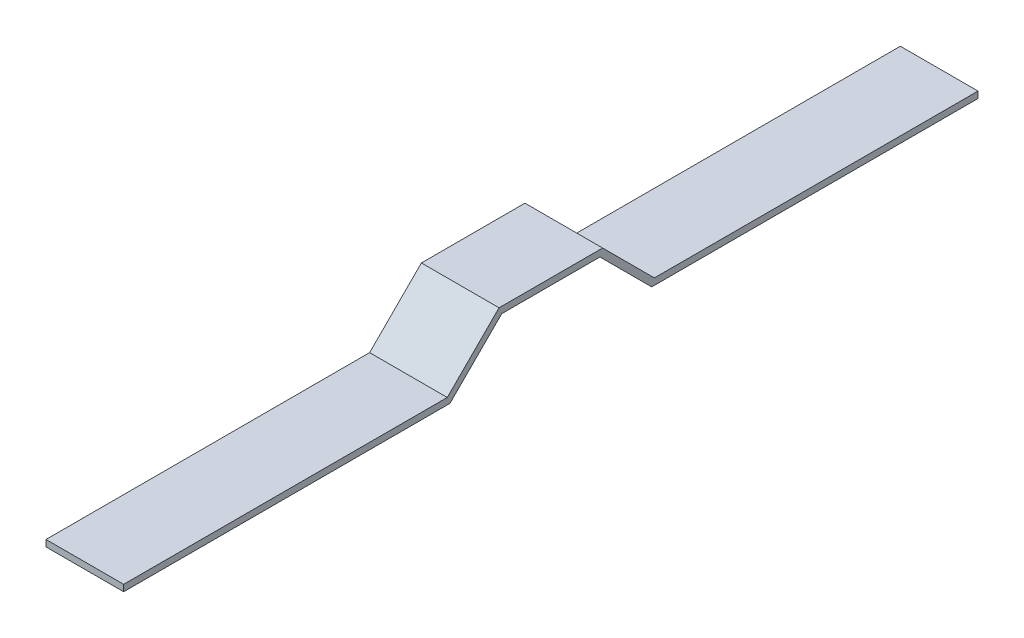
ISO-10303-21;
HEADER;
FILE_DESCRIPTION(('STEP AP214'),'2;1');
FILE_NAME('part.step','',(''),(''),'','','');
FILE_SCHEMA(('AUTOMOTIVE_DESIGN { 1 0 10303 214 1 1 1 1 }'));
ENDSEC;
DATA;
#1=APPLICATION_CONTEXT('core data for automotive mechanical design processes');
#2=APPLICATION_PROTOCOL_DEFINITION('international standard','automotive_design',2000,#1);
#3=PRODUCT_CONTEXT('',#1,'mechanical');
#4=PRODUCT('Part','Part','',(#3));
#5=PRODUCT_RELATED_PRODUCT_CATEGORY('part','',(#4));
#6=PRODUCT_DEFINITION_FORMATION('','',#4);
#7=PRODUCT_DEFINITION_CONTEXT('part definition',#1,'design');
#8=PRODUCT_DEFINITION('design','',#6,#7);
#9=PRODUCT_DEFINITION_SHAPE('','',#8);
#10=(LENGTH_UNIT() NAMED_UNIT(*) SI_UNIT(.MILLI.,.METRE.));
#11=(NAMED_UNIT(*) PLANE_ANGLE_UNIT() SI_UNIT($,.RADIAN.));
#12=(NAMED_UNIT(*) SI_UNIT($,.STERADIAN.) SOLID_ANGLE_UNIT());
#13=UNCERTAINTY_MEASURE_WITH_UNIT(LENGTH_MEASURE(1.E-05),#10,'distance_accuracy_value','');
#14=(GEOMETRIC_REPRESENTATION_CONTEXT(3) GLOBAL_UNCERTAINTY_ASSIGNED_CONTEXT((#13)) GLOBAL_UNIT_ASSIGNED_CONTEXT((#10,
#11,#12)) REPRESENTATION_CONTEXT('',''));
#15=CARTESIAN_POINT('',(0.,0.,0.));
#16=DIRECTION('',(0.,0.,1.));
#17=DIRECTION('',(1.,0.,0.));
#18=AXIS2_PLACEMENT_3D('',#15,#16,#17);
#19=CARTESIAN_POINT('',(38.1,-11.8301369863014,145.441095890411));
#20=DIRECTION('',(0.,0.,-1.));
#21=DIRECTION('',(-1.,0.,0.));
#22=AXIS2_PLACEMENT_3D('',#19,#20,#21);
#23=PLANE('',#22);
#24=DIRECTION('',(0.,-1.,0.));
#25=VECTOR('',#24,1.);
#26=CARTESIAN_POINT('',(0.,-11.8301369863014,145.441095890411));
#27=LINE('',#26,#25);
#28=CARTESIAN_POINT('',(0.,-11.8301369863014,145.441095890411));
#29=VERTEX_POINT('',#28);
#30=CARTESIAN_POINT('',(0.,-15.0051369863014,145.441095890411));
#31=VERTEX_POINT('',#30);
#32=EDGE_CURVE('E154',#29,#31,#27,.T.);
#33=ORIENTED_EDGE('',*,*,#32,.T.);
#34=DIRECTION('',(-1.,0.,0.));
#35=VECTOR('',#34,1.);
#36=CARTESIAN_POINT('',(38.1,-15.0051369863014,145.441095890411));
#37=LINE('',#36,#35);
#38=CARTESIAN_POINT('',(38.1,-15.0051369863014,145.441095890411));
#39=VERTEX_POINT('',#38);
#40=EDGE_CURVE('E11',#39,#31,#37,.T.);
#41=ORIENTED_EDGE('',*,*,#40,.F.);
#42=DIRECTION('',(0.,-1.,0.));
#43=VECTOR('',#42,1.);
#44=CARTESIAN_POINT('',(38.1,-11.8301369863014,145.441095890411));
#45=LINE('',#44,#43);
#46=CARTESIAN_POINT('',(38.1,-11.8301369863014,145.441095890411));
#47=VERTEX_POINT('',#46);
#48=EDGE_CURVE('E176',#47,#39,#45,.T.);
#49=ORIENTED_EDGE('',*,*,#48,.F.);
#50=DIRECTION('',(-1.,0.,0.));
#51=VECTOR('',#50,1.);
#52=CARTESIAN_POINT('',(38.1,-11.8301369863014,145.441095890411));
#53=LINE('',#52,#51);
#54=EDGE_CURVE('E150',#47,#29,#53,.T.);
#55=ORIENTED_EDGE('',*,*,#54,.T.);
#56=EDGE_LOOP('',(#33,#41,#49,#55));
#57=FACE_BOUND('',#56,.T.);
#58=ADVANCED_FACE('F34',(#57),#23,.F.);
#59=CARTESIAN_POINT('',(38.1,-15.0051369863014,145.441095890411));
#60=DIRECTION('',(0.,1.,0.));
#61=DIRECTION('',(0.,0.,1.));
#62=AXIS2_PLACEMENT_3D('',#59,#60,#61);
#63=PLANE('',#62);
#64=DIRECTION('',(0.,0.,-1.));
#65=VECTOR('',#64,1.);
#66=CARTESIAN_POINT('',(0.,-15.0051369863014,145.441095890411));
#67=LINE('',#66,#65);
#68=CARTESIAN_POINT('',(0.,-15.0051369863014,-14.6240321701235));
#69=VERTEX_POINT('',#68);
#70=EDGE_CURVE('E157',#31,#69,#67,.T.);
#71=ORIENTED_EDGE('',*,*,#70,.T.);
#72=DIRECTION('',(-1.,0.,0.));
#73=VECTOR('',#72,1.);
#74=CARTESIAN_POINT('',(38.1,-15.0051369863014,-14.6240321701235));
#75=LINE('',#74,#73);
#76=CARTESIAN_POINT('',(38.1,-15.0051369863014,-14.6240321701235));
#77=VERTEX_POINT('',#76);
#78=EDGE_CURVE('E42',#77,#69,#75,.T.);
#79=ORIENTED_EDGE('',*,*,#78,.F.);
#80=DIRECTION('',(0.,0.,-1.));
#81=VECTOR('',#80,1.);
#82=CARTESIAN_POINT('',(38.1,-15.0051369863014,145.441095890411));
#83=LINE('',#82,#81);
#84=EDGE_CURVE('E105',#39,#77,#83,.T.);
#85=ORIENTED_EDGE('',*,*,#84,.F.);
#86=ORIENTED_EDGE('',*,*,#40,.T.);
#87=EDGE_LOOP('',(#71,#79,#85,#86));
#88=FACE_BOUND('',#87,.T.);
#89=ADVANCED_FACE('F254',(#88),#63,.F.);
#90=CARTESIAN_POINT('',(38.1,-15.0051369863014,-14.6240321701235));
#91=DIRECTION('',(0.,0.707106781186547,0.707106781186548));
#92=DIRECTION('',(0.,-0.707106781186548,0.707106781186547));
#93=AXIS2_PLACEMENT_3D('',#90,#91,#92);
#94=PLANE('',#93);
#95=DIRECTION('',(0.,0.707106781186548,-0.707106781186547));
#96=VECTOR('',#95,1.);
#97=CARTESIAN_POINT('',(0.,-15.0051369863014,-14.6240321701235));
#98=LINE('',#97,#96);
#99=CARTESIAN_POINT('',(0.,10.3948630136986,-40.0240321701235));
#100=VERTEX_POINT('',#99);
#101=EDGE_CURVE('E159',#69,#100,#98,.T.);
#102=ORIENTED_EDGE('',*,*,#101,.T.);
#103=DIRECTION('',(-1.,0.,0.));
#104=VECTOR('',#103,1.);
#105=CARTESIAN_POINT('',(38.1,10.3948630136986,-40.0240321701235));
#106=LINE('',#105,#104);
#107=CARTESIAN_POINT('',(38.1,10.3948630136986,-40.0240321701235));
#108=VERTEX_POINT('',#107);
#109=EDGE_CURVE('E195',#108,#100,#106,.T.);
#110=ORIENTED_EDGE('',*,*,#109,.F.);
#111=DIRECTION('',(0.,0.707106781186548,-0.707106781186547));
#112=VECTOR('',#111,1.);
#113=CARTESIAN_POINT('',(38.1,-15.0051369863014,-14.6240321701235));
#114=LINE('',#113,#112);
#115=EDGE_CURVE('E203',#77,#108,#114,.T.);
#116=ORIENTED_EDGE('',*,*,#115,.F.);
#117=ORIENTED_EDGE('',*,*,#78,.T.);
#118=EDGE_LOOP('',(#102,#110,#116,#117));
#119=FACE_BOUND('',#118,.T.);
#120=ADVANCED_FACE('F201',(#119),#94,.F.);
#121=CARTESIAN_POINT('',(38.1,10.3948630136986,-40.0240321701235));
#122=DIRECTION('',(0.,1.,0.));
#123=DIRECTION('',(0.,0.,1.));
#124=AXIS2_PLACEMENT_3D('',#121,#122,#123);
#125=PLANE('',#124);
#126=DIRECTION('',(0.,0.,-1.));
#127=VECTOR('',#126,1.);
#128=CARTESIAN_POINT('',(0.,10.3948630136986,-40.0240321701235));
#129=LINE('',#128,#127);
#130=CARTESIAN_POINT('',(0.,10.3948630136986,-88.1937760490543));
#131=VERTEX_POINT('',#130);
#132=EDGE_CURVE('E161',#100,#131,#129,.T.);
#133=ORIENTED_EDGE('',*,*,#132,.T.);
#134=DIRECTION('',(-1.,0.,0.));
#135=VECTOR('',#134,1.);
#136=CARTESIAN_POINT('',(38.1,10.3948630136986,-88.1937760490543));
#137=LINE('',#136,#135);
#138=CARTESIAN_POINT('',(38.1,10.3948630136986,-88.1937760490543));
#139=VERTEX_POINT('',#138);
#140=EDGE_CURVE('E192',#139,#131,#137,.T.);
#141=ORIENTED_EDGE('',*,*,#140,.F.);
#142=DIRECTION('',(0.,0.,-1.));
#143=VECTOR('',#142,1.);
#144=CARTESIAN_POINT('',(38.1,10.3948630136986,-40.0240321701235));
#145=LINE('',#144,#143);
#146=EDGE_CURVE('E221',#108,#139,#145,.T.);
#147=ORIENTED_EDGE('',*,*,#146,.F.);
#148=ORIENTED_EDGE('',*,*,#109,.T.);
#149=EDGE_LOOP('',(#133,#141,#147,#148));
#150=FACE_BOUND('',#149,.T.);
#151=ADVANCED_FACE('F212',(#150),#125,.F.);
#152=CARTESIAN_POINT('',(38.1,10.3948630136986,-88.1937760490543));
#153=DIRECTION('',(0.,0.707106781186548,-0.707106781186547));
#154=DIRECTION('',(0.,0.707106781186547,0.707106781186548));
#155=AXIS2_PLACEMENT_3D('',#152,#153,#154);
#156=PLANE('',#155);
#157=DIRECTION('',(0.,-0.707106781186547,-0.707106781186548));
#158=VECTOR('',#157,1.);
#159=CARTESIAN_POINT('',(0.,10.3948630136986,-88.1937760490543));
#160=LINE('',#159,#158);
#161=CARTESIAN_POINT('',(0.,-15.0051369863014,-113.593776049054));
#162=VERTEX_POINT('',#161);
#163=EDGE_CURVE('E163',#131,#162,#160,.T.);
#164=ORIENTED_EDGE('',*,*,#163,.T.);
#165=DIRECTION('',(-1.,0.,0.));
#166=VECTOR('',#165,1.);
#167=CARTESIAN_POINT('',(38.1,-15.0051369863014,-113.593776049054));
#168=LINE('',#167,#166);
#169=CARTESIAN_POINT('',(38.1,-15.0051369863014,-113.593776049054));
#170=VERTEX_POINT('',#169);
#171=EDGE_CURVE('E189',#170,#162,#168,.T.);
#172=ORIENTED_EDGE('',*,*,#171,.F.);
#173=DIRECTION('',(0.,-0.707106781186547,-0.707106781186548));
#174=VECTOR('',#173,1.);
#175=CARTESIAN_POINT('',(38.1,10.3948630136986,-88.1937760490543));
#176=LINE('',#175,#174);
#177=EDGE_CURVE('E218',#139,#170,#176,.T.);
#178=ORIENTED_EDGE('',*,*,#177,.F.);
#179=ORIENTED_EDGE('',*,*,#140,.T.);
#180=EDGE_LOOP('',(#164,#172,#178,#179));
#181=FACE_BOUND('',#180,.T.);
#182=ADVANCED_FACE('F216',(#181),#156,.F.);
#183=CARTESIAN_POINT('',(38.1,-15.0051369863014,-113.593776049054));
#184=DIRECTION('',(0.,1.,0.));
#185=DIRECTION('',(0.,0.,1.));
#186=AXIS2_PLACEMENT_3D('',#183,#184,#185);
#187=PLANE('',#186);
#188=DIRECTION('',(0.,0.,-1.));
#189=VECTOR('',#188,1.);
#190=CARTESIAN_POINT('',(0.,-15.0051369863014,-113.593776049054));
#191=LINE('',#190,#189);
#192=CARTESIAN_POINT('',(0.,-15.0051369863014,-273.658904109589));
#193=VERTEX_POINT('',#192);
#194=EDGE_CURVE('E165',#162,#193,#191,.T.);
#195=ORIENTED_EDGE('',*,*,#194,.T.);
#196=DIRECTION('',(-1.,0.,0.));
#197=VECTOR('',#196,1.);
#198=CARTESIAN_POINT('',(38.1,-15.0051369863014,-273.658904109589));
#199=LINE('',#198,#197);
#200=CARTESIAN_POINT('',(38.1,-15.0051369863014,-273.658904109589));
#201=VERTEX_POINT('',#200);
#202=EDGE_CURVE('E186',#201,#193,#199,.T.);
#203=ORIENTED_EDGE('',*,*,#202,.F.);
#204=DIRECTION('',(0.,0.,-1.));
#205=VECTOR('',#204,1.);
#206=CARTESIAN_POINT('',(38.1,-15.0051369863014,-113.593776049054));
#207=LINE('',#206,#205);
#208=EDGE_CURVE('E220',#170,#201,#207,.T.);
#209=ORIENTED_EDGE('',*,*,#208,.F.);
#210=ORIENTED_EDGE('',*,*,#171,.T.);
#211=EDGE_LOOP('',(#195,#203,#209,#210));
#212=FACE_BOUND('',#211,.T.);
#213=ADVANCED_FACE('F267',(#212),#187,.F.);
#214=CARTESIAN_POINT('',(38.1,-15.0051369863014,-273.658904109589));
#215=DIRECTION('',(0.,0.,1.));
#216=DIRECTION('',(1.,0.,0.));
#217=AXIS2_PLACEMENT_3D('',#214,#215,#216);
#218=PLANE('',#217);
#219=DIRECTION('',(0.,1.,0.));
#220=VECTOR('',#219,1.);
#221=CARTESIAN_POINT('',(0.,-15.0051369863014,-273.658904109589));
#222=LINE('',#221,#220);
#223=CARTESIAN_POINT('',(0.,-11.8301369863014,-273.658904109589));
#224=VERTEX_POINT('',#223);
#225=EDGE_CURVE('E167',#193,#224,#222,.T.);
#226=ORIENTED_EDGE('',*,*,#225,.T.);
#227=DIRECTION('',(-1.,0.,0.));
#228=VECTOR('',#227,1.);
#229=CARTESIAN_POINT('',(38.1,-11.8301369863014,-273.658904109589));
#230=LINE('',#229,#228);
#231=CARTESIAN_POINT('',(38.1,-11.8301369863014,-273.658904109589));
#232=VERTEX_POINT('',#231);
#233=EDGE_CURVE('E183',#232,#224,#230,.T.);
#234=ORIENTED_EDGE('',*,*,#233,.F.);
#235=DIRECTION('',(0.,1.,0.));
#236=VECTOR('',#235,1.);
#237=CARTESIAN_POINT('',(38.1,-15.0051369863014,-273.658904109589));
#238=LINE('',#237,#236);
#239=EDGE_CURVE('E223',#201,#232,#238,.T.);
#240=ORIENTED_EDGE('',*,*,#239,.F.);
#241=ORIENTED_EDGE('',*,*,#202,.T.);
#242=EDGE_LOOP('',(#226,#234,#240,#241));
#243=FACE_BOUND('',#242,.T.);
#244=ADVANCED_FACE('F270',(#243),#218,.F.);
#245=CARTESIAN_POINT('',(38.1,-11.8301369863014,-114.908904109589));
#246=DIRECTION('',(0.,-1.,0.));
#247=DIRECTION('',(0.,0.,-1.));
#248=AXIS2_PLACEMENT_3D('',#245,#246,#247);
#249=PLANE('',#248);
#250=DIRECTION('',(0.,0.,1.));
#251=VECTOR('',#250,1.);
#252=CARTESIAN_POINT('',(0.,-11.8301369863014,-114.908904109589));
#253=LINE('',#252,#251);
#254=CARTESIAN_POINT('',(0.,-11.8301369863014,-114.908904109589));
#255=VERTEX_POINT('',#254);
#256=EDGE_CURVE('E169',#224,#255,#253,.T.);
#257=ORIENTED_EDGE('',*,*,#256,.T.);
#258=DIRECTION('',(-1.,0.,0.));
#259=VECTOR('',#258,1.);
#260=CARTESIAN_POINT('',(38.1,-11.8301369863014,-114.908904109589));
#261=LINE('',#260,#259);
#262=CARTESIAN_POINT('',(38.1,-11.8301369863014,-114.908904109589));
#263=VERTEX_POINT('',#262);
#264=EDGE_CURVE('E180',#263,#255,#261,.T.);
#265=ORIENTED_EDGE('',*,*,#264,.F.);
#266=DIRECTION('',(0.,0.,1.));
#267=VECTOR('',#266,1.);
#268=CARTESIAN_POINT('',(38.1,-11.8301369863014,-114.908904109589));
#269=LINE('',#268,#267);
#270=EDGE_CURVE('E229',#232,#263,#269,.T.);
#271=ORIENTED_EDGE('',*,*,#270,.F.);
#272=ORIENTED_EDGE('',*,*,#233,.T.);
#273=EDGE_LOOP('',(#257,#265,#271,#272));
#274=FACE_BOUND('',#273,.T.);
#275=ADVANCED_FACE('F235',(#274),#249,.F.);
#276=CARTESIAN_POINT('',(38.1,13.5698630136986,-89.5089041095889));
#277=DIRECTION('',(0.,-0.707106781186548,0.707106781186547));
#278=DIRECTION('',(0.,-0.707106781186547,-0.707106781186548));
#279=AXIS2_PLACEMENT_3D('',#276,#277,#278);
#280=PLANE('',#279);
#281=DIRECTION('',(0.,0.707106781186547,0.707106781186548));
#282=VECTOR('',#281,1.);
#283=CARTESIAN_POINT('',(0.,13.5698630136986,-89.5089041095889));
#284=LINE('',#283,#282);
#285=CARTESIAN_POINT('',(0.,13.5698630136986,-89.5089041095889));
#286=VERTEX_POINT('',#285);
#287=EDGE_CURVE('E171',#255,#286,#284,.T.);
#288=ORIENTED_EDGE('',*,*,#287,.T.);
#289=DIRECTION('',(-1.,0.,0.));
#290=VECTOR('',#289,1.);
#291=CARTESIAN_POINT('',(38.1,13.5698630136986,-89.5089041095889));
#292=LINE('',#291,#290);
#293=CARTESIAN_POINT('',(38.1,13.5698630136986,-89.5089041095889));
#294=VERTEX_POINT('',#293);
#295=EDGE_CURVE('E145',#294,#286,#292,.T.);
#296=ORIENTED_EDGE('',*,*,#295,.F.);
#297=DIRECTION('',(0.,0.707106781186547,0.707106781186548));
#298=VECTOR('',#297,1.);
#299=CARTESIAN_POINT('',(38.1,13.5698630136986,-89.5089041095889));
#300=LINE('',#299,#298);
#301=EDGE_CURVE('E136',#263,#294,#300,.T.);
#302=ORIENTED_EDGE('',*,*,#301,.F.);
#303=ORIENTED_EDGE('',*,*,#264,.T.);
#304=EDGE_LOOP('',(#288,#296,#302,#303));
#305=FACE_BOUND('',#304,.T.);
#306=ADVANCED_FACE('F239',(#305),#280,.F.);
#307=CARTESIAN_POINT('',(38.1,13.5698630136986,-38.7089041095889));
#308=DIRECTION('',(0.,-1.,0.));
#309=DIRECTION('',(0.,0.,-1.));
#310=AXIS2_PLACEMENT_3D('',#307,#308,#309);
#311=PLANE('',#310);
#312=DIRECTION('',(0.,0.,1.));
#313=VECTOR('',#312,1.);
#314=CARTESIAN_POINT('',(0.,13.5698630136986,-38.7089041095889));
#315=LINE('',#314,#313);
#316=CARTESIAN_POINT('',(0.,13.5698630136986,-38.7089041095889));
#317=VERTEX_POINT('',#316);
#318=EDGE_CURVE('E144',#286,#317,#315,.T.);
#319=ORIENTED_EDGE('',*,*,#318,.T.);
#320=DIRECTION('',(-1.,0.,0.));
#321=VECTOR('',#320,1.);
#322=CARTESIAN_POINT('',(38.1,13.5698630136986,-38.7089041095889));
#323=LINE('',#322,#321);
#324=CARTESIAN_POINT('',(38.1,13.5698630136986,-38.7089041095889));
#325=VERTEX_POINT('',#324);
#326=EDGE_CURVE('E141',#325,#317,#323,.T.);
#327=ORIENTED_EDGE('',*,*,#326,.F.);
#328=DIRECTION('',(0.,0.,1.));
#329=VECTOR('',#328,1.);
#330=CARTESIAN_POINT('',(38.1,13.5698630136986,-38.7089041095889));
#331=LINE('',#330,#329);
#332=EDGE_CURVE('E130',#294,#325,#331,.T.);
#333=ORIENTED_EDGE('',*,*,#332,.F.);
#334=ORIENTED_EDGE('',*,*,#295,.T.);
#335=EDGE_LOOP('',(#319,#327,#333,#334));
#336=FACE_BOUND('',#335,.T.);
#337=ADVANCED_FACE('F142',(#336),#311,.F.);
#338=CARTESIAN_POINT('',(38.1,-11.8301369863014,-13.3089041095889));
#339=DIRECTION('',(0.,-0.707106781186547,-0.707106781186548));
#340=DIRECTION('',(0.,0.707106781186548,-0.707106781186547));
#341=AXIS2_PLACEMENT_3D('',#338,#339,#340);
#342=PLANE('',#341);
#343=DIRECTION('',(0.,-0.707106781186548,0.707106781186547));
#344=VECTOR('',#343,1.);
#345=CARTESIAN_POINT('',(0.,-11.8301369863014,-13.3089041095889));
#346=LINE('',#345,#344);
#347=CARTESIAN_POINT('',(0.,-11.8301369863014,-13.3089041095889));
#348=VERTEX_POINT('',#347);
#349=EDGE_CURVE('E91',#317,#348,#346,.T.);
#350=ORIENTED_EDGE('',*,*,#349,.T.);
#351=DIRECTION('',(-1.,0.,0.));
#352=VECTOR('',#351,1.);
#353=CARTESIAN_POINT('',(38.1,-11.8301369863014,-13.3089041095889));
#354=LINE('',#353,#352);
#355=CARTESIAN_POINT('',(38.1,-11.8301369863014,-13.3089041095889));
#356=VERTEX_POINT('',#355);
#357=EDGE_CURVE('E146',#356,#348,#354,.T.);
#358=ORIENTED_EDGE('',*,*,#357,.F.);
#359=DIRECTION('',(0.,-0.707106781186548,0.707106781186547));
#360=VECTOR('',#359,1.);
#361=CARTESIAN_POINT('',(38.1,-11.8301369863014,-13.3089041095889));
#362=LINE('',#361,#360);
#363=EDGE_CURVE('E134',#325,#356,#362,.T.);
#364=ORIENTED_EDGE('',*,*,#363,.F.);
#365=ORIENTED_EDGE('',*,*,#326,.T.);
#366=EDGE_LOOP('',(#350,#358,#364,#365));
#367=FACE_BOUND('',#366,.T.);
#368=ADVANCED_FACE('F148',(#367),#342,.F.);
#369=CARTESIAN_POINT('',(38.1,-11.8301369863014,145.441095890411));
#370=DIRECTION('',(0.,-1.,0.));
#371=DIRECTION('',(0.,0.,-1.));
#372=AXIS2_PLACEMENT_3D('',#369,#370,#371);
#373=PLANE('',#372);
#374=DIRECTION('',(0.,0.,1.));
#375=VECTOR('',#374,1.);
#376=CARTESIAN_POINT('',(0.,-11.8301369863014,145.441095890411));
#377=LINE('',#376,#375);
#378=EDGE_CURVE('E97',#348,#29,#377,.T.);
#379=ORIENTED_EDGE('',*,*,#378,.T.);
#380=ORIENTED_EDGE('',*,*,#54,.F.);
#381=DIRECTION('',(0.,0.,1.));
#382=VECTOR('',#381,1.);
#383=CARTESIAN_POINT('',(38.1,-11.8301369863014,145.441095890411));
#384=LINE('',#383,#382);
#385=EDGE_CURVE('E50',#356,#47,#384,.T.);
#386=ORIENTED_EDGE('',*,*,#385,.F.);
#387=ORIENTED_EDGE('',*,*,#357,.T.);
#388=EDGE_LOOP('',(#379,#380,#386,#387));
#389=FACE_BOUND('',#388,.T.);
#390=ADVANCED_FACE('F243',(#389),#373,.F.);
#391=CARTESIAN_POINT('',(38.1,0.,0.));
#392=DIRECTION('',(1.,0.,0.));
#393=DIRECTION('',(0.,0.,-1.));
#394=AXIS2_PLACEMENT_3D('',#391,#392,#393);
#395=PLANE('',#394);
#396=ORIENTED_EDGE('',*,*,#48,.T.);
#397=ORIENTED_EDGE('',*,*,#84,.T.);
#398=ORIENTED_EDGE('',*,*,#115,.T.);
#399=ORIENTED_EDGE('',*,*,#146,.T.);
#400=ORIENTED_EDGE('',*,*,#177,.T.);
#401=ORIENTED_EDGE('',*,*,#208,.T.);
#402=ORIENTED_EDGE('',*,*,#239,.T.);
#403=ORIENTED_EDGE('',*,*,#270,.T.);
#404=ORIENTED_EDGE('',*,*,#301,.T.);
#405=ORIENTED_EDGE('',*,*,#332,.T.);
#406=ORIENTED_EDGE('',*,*,#363,.T.);
#407=ORIENTED_EDGE('',*,*,#385,.T.);
#408=EDGE_LOOP('',(#396,#397,#398,#399,#400,#401,#402,#403,#404,#405,#406,#407));
#409=FACE_BOUND('',#408,.T.);
#410=ADVANCED_FACE('F132',(#409),#395,.T.);
#411=CARTESIAN_POINT('',(0.,0.,0.));
#412=DIRECTION('',(1.,0.,0.));
#413=DIRECTION('',(0.,0.,-1.));
#414=AXIS2_PLACEMENT_3D('',#411,#412,#413);
#415=PLANE('',#414);
#416=ORIENTED_EDGE('',*,*,#32,.F.);
#417=ORIENTED_EDGE('',*,*,#378,.F.);
#418=ORIENTED_EDGE('',*,*,#349,.F.);
#419=ORIENTED_EDGE('',*,*,#318,.F.);
#420=ORIENTED_EDGE('',*,*,#287,.F.);
#421=ORIENTED_EDGE('',*,*,#256,.F.);
#422=ORIENTED_EDGE('',*,*,#225,.F.);
#423=ORIENTED_EDGE('',*,*,#194,.F.);
#424=ORIENTED_EDGE('',*,*,#163,.F.);
#425=ORIENTED_EDGE('',*,*,#132,.F.);
#426=ORIENTED_EDGE('',*,*,#101,.F.);
#427=ORIENTED_EDGE('',*,*,#70,.F.);
#428=EDGE_LOOP('',(#416,#417,#418,#419,#420,#421,#422,#423,#424,#425,#426,#427));
#429=FACE_BOUND('',#428,.T.);
#430=ADVANCED_FACE('F207',(#429),#415,.F.);
#431=CLOSED_SHELL('',(#58,#89,#120,#151,#182,#213,#244,#275,#306,#337,#368,#390,#410,#430));
#432=MANIFOLD_SOLID_BREP('B2',#431);
#433=ADVANCED_BREP_SHAPE_REPRESENTATION('',(#18,#432),#14);
#434=SHAPE_DEFINITION_REPRESENTATION(#9,#433);
ENDSEC;
END-ISO-10303-21;
